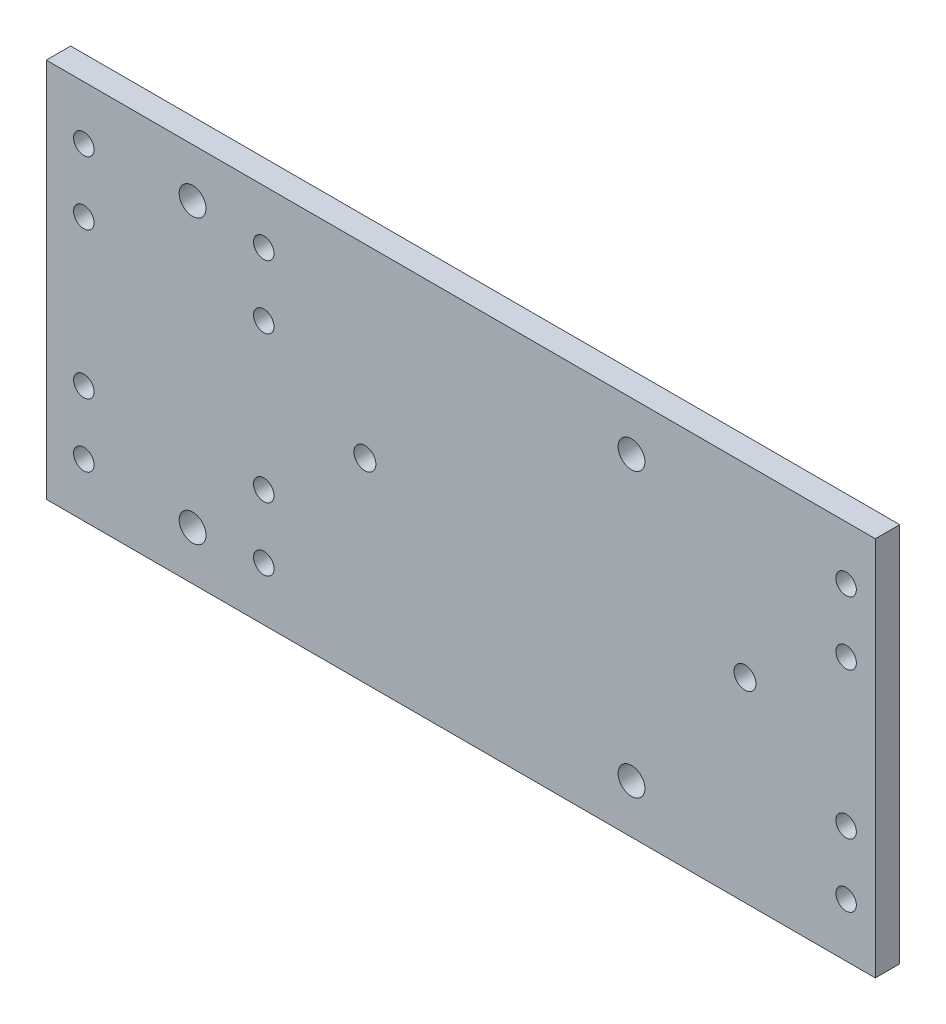
ISO-10303-21;
HEADER;
FILE_DESCRIPTION(('STEP AP214'),'2;1');
FILE_NAME('part.step','',(''),(''),'','','');
FILE_SCHEMA(('AUTOMOTIVE_DESIGN { 1 0 10303 214 1 1 1 1 }'));
ENDSEC;
DATA;
#1=APPLICATION_CONTEXT('core data for automotive mechanical design processes');
#2=APPLICATION_PROTOCOL_DEFINITION('international standard','automotive_design',2000,#1);
#3=PRODUCT_CONTEXT('',#1,'mechanical');
#4=PRODUCT('Part','Part','',(#3));
#5=PRODUCT_RELATED_PRODUCT_CATEGORY('part','',(#4));
#6=PRODUCT_DEFINITION_FORMATION('','',#4);
#7=PRODUCT_DEFINITION_CONTEXT('part definition',#1,'design');
#8=PRODUCT_DEFINITION('design','',#6,#7);
#9=PRODUCT_DEFINITION_SHAPE('','',#8);
#10=(LENGTH_UNIT() NAMED_UNIT(*) SI_UNIT(.MILLI.,.METRE.));
#11=(NAMED_UNIT(*) PLANE_ANGLE_UNIT() SI_UNIT($,.RADIAN.));
#12=(NAMED_UNIT(*) SI_UNIT($,.STERADIAN.) SOLID_ANGLE_UNIT());
#13=UNCERTAINTY_MEASURE_WITH_UNIT(LENGTH_MEASURE(1.E-05),#10,'distance_accuracy_value','');
#14=(GEOMETRIC_REPRESENTATION_CONTEXT(3) GLOBAL_UNCERTAINTY_ASSIGNED_CONTEXT((#13)) GLOBAL_UNIT_ASSIGNED_CONTEXT((#10,
#11,#12)) REPRESENTATION_CONTEXT('',''));
#15=CARTESIAN_POINT('',(0.,0.,0.));
#16=DIRECTION('',(0.,0.,1.));
#17=DIRECTION('',(1.,0.,0.));
#18=AXIS2_PLACEMENT_3D('',#15,#16,#17);
#19=CARTESIAN_POINT('',(0.,0.,5.));
#20=DIRECTION('',(0.,0.,1.));
#21=DIRECTION('',(1.,0.,0.));
#22=AXIS2_PLACEMENT_3D('',#19,#20,#21);
#23=PLANE('',#22);
#24=CARTESIAN_POINT('',(-5.99999999999992,67.0000000000001,5.));
#25=DIRECTION('',(0.,0.,1.));
#26=DIRECTION('',(1.,0.,0.));
#27=AXIS2_PLACEMENT_3D('',#24,#25,#26);
#28=CIRCLE('',#27,2.09999999999999);
#29=CARTESIAN_POINT('',(-3.89999999999993,67.0000000000001,5.));
#30=VERTEX_POINT('',#29);
#31=EDGE_CURVE('E518',#30,#30,#28,.T.);
#32=ORIENTED_EDGE('',*,*,#31,.F.);
#33=EDGE_LOOP('',(#32));
#34=FACE_BOUND('',#33,.T.);
#35=CARTESIAN_POINT('',(-5.99999999999989,24.,5.));
#36=DIRECTION('',(0.,0.,1.));
#37=DIRECTION('',(1.,0.,0.));
#38=AXIS2_PLACEMENT_3D('',#35,#36,#37);
#39=CIRCLE('',#38,2.09999999999999);
#40=CARTESIAN_POINT('',(-3.8999999999999,24.,5.));
#41=VERTEX_POINT('',#40);
#42=EDGE_CURVE('E512',#41,#41,#39,.T.);
#43=ORIENTED_EDGE('',*,*,#42,.F.);
#44=EDGE_LOOP('',(#43));
#45=FACE_BOUND('',#44,.T.);
#46=CARTESIAN_POINT('',(-5.99999999999992,11.,5.));
#47=DIRECTION('',(0.,0.,1.));
#48=DIRECTION('',(1.,0.,0.));
#49=AXIS2_PLACEMENT_3D('',#46,#47,#48);
#50=CIRCLE('',#49,2.09999999999999);
#51=CARTESIAN_POINT('',(-3.89999999999993,11.,5.));
#52=VERTEX_POINT('',#51);
#53=EDGE_CURVE('E506',#52,#52,#50,.T.);
#54=ORIENTED_EDGE('',*,*,#53,.F.);
#55=EDGE_LOOP('',(#54));
#56=FACE_BOUND('',#55,.T.);
#57=CARTESIAN_POINT('',(-5.99999999999989,54.0000000000001,5.));
#58=DIRECTION('',(0.,0.,1.));
#59=DIRECTION('',(1.,0.,0.));
#60=AXIS2_PLACEMENT_3D('',#57,#58,#59);
#61=CIRCLE('',#60,2.09999999999999);
#62=CARTESIAN_POINT('',(-3.8999999999999,54.0000000000001,5.));
#63=VERTEX_POINT('',#62);
#64=EDGE_CURVE('E500',#63,#63,#61,.T.);
#65=ORIENTED_EDGE('',*,*,#64,.F.);
#66=EDGE_LOOP('',(#65));
#67=FACE_BOUND('',#66,.T.);
#68=CARTESIAN_POINT('',(-125.4,67.0000000000001,5.));
#69=DIRECTION('',(0.,0.,1.));
#70=DIRECTION('',(1.,0.,0.));
#71=AXIS2_PLACEMENT_3D('',#68,#69,#70);
#72=CIRCLE('',#71,2.09999999999999);
#73=CARTESIAN_POINT('',(-123.3,67.0000000000001,5.));
#74=VERTEX_POINT('',#73);
#75=EDGE_CURVE('E494',#74,#74,#72,.T.);
#76=ORIENTED_EDGE('',*,*,#75,.F.);
#77=EDGE_LOOP('',(#76));
#78=FACE_BOUND('',#77,.T.);
#79=CARTESIAN_POINT('',(-125.4,24.,5.));
#80=DIRECTION('',(0.,0.,1.));
#81=DIRECTION('',(1.,0.,0.));
#82=AXIS2_PLACEMENT_3D('',#79,#80,#81);
#83=CIRCLE('',#82,2.09999999999999);
#84=CARTESIAN_POINT('',(-123.3,24.,5.));
#85=VERTEX_POINT('',#84);
#86=EDGE_CURVE('E488',#85,#85,#83,.T.);
#87=ORIENTED_EDGE('',*,*,#86,.F.);
#88=EDGE_LOOP('',(#87));
#89=FACE_BOUND('',#88,.T.);
#90=CARTESIAN_POINT('',(-125.4,11.,5.));
#91=DIRECTION('',(0.,0.,1.));
#92=DIRECTION('',(1.,0.,0.));
#93=AXIS2_PLACEMENT_3D('',#90,#91,#92);
#94=CIRCLE('',#93,2.09999999999999);
#95=CARTESIAN_POINT('',(-123.3,11.,5.));
#96=VERTEX_POINT('',#95);
#97=EDGE_CURVE('E482',#96,#96,#94,.T.);
#98=ORIENTED_EDGE('',*,*,#97,.F.);
#99=EDGE_LOOP('',(#98));
#100=FACE_BOUND('',#99,.T.);
#101=CARTESIAN_POINT('',(-125.4,54.0000000000001,5.));
#102=DIRECTION('',(0.,0.,1.));
#103=DIRECTION('',(1.,0.,0.));
#104=AXIS2_PLACEMENT_3D('',#101,#102,#103);
#105=CIRCLE('',#104,2.09999999999999);
#106=CARTESIAN_POINT('',(-123.3,54.0000000000001,5.));
#107=VERTEX_POINT('',#106);
#108=EDGE_CURVE('E473',#107,#107,#105,.T.);
#109=ORIENTED_EDGE('',*,*,#108,.F.);
#110=EDGE_LOOP('',(#109));
#111=FACE_BOUND('',#110,.T.);
#112=CARTESIAN_POINT('',(-162.3,54.0000000000001,5.));
#113=DIRECTION('',(0.,0.,1.));
#114=DIRECTION('',(1.,0.,0.));
#115=AXIS2_PLACEMENT_3D('',#112,#113,#114);
#116=CIRCLE('',#115,2.09999999999999);
#117=CARTESIAN_POINT('',(-160.2,54.0000000000001,5.));
#118=VERTEX_POINT('',#117);
#119=EDGE_CURVE('E129',#118,#118,#116,.T.);
#120=ORIENTED_EDGE('',*,*,#119,.F.);
#121=EDGE_LOOP('',(#120));
#122=FACE_BOUND('',#121,.T.);
#123=CARTESIAN_POINT('',(-162.3,67.0000000000001,5.));
#124=DIRECTION('',(0.,0.,1.));
#125=DIRECTION('',(1.,0.,0.));
#126=AXIS2_PLACEMENT_3D('',#123,#124,#125);
#127=CIRCLE('',#126,2.09999999999999);
#128=CARTESIAN_POINT('',(-160.2,67.0000000000001,5.));
#129=VERTEX_POINT('',#128);
#130=EDGE_CURVE('E119',#129,#129,#127,.T.);
#131=ORIENTED_EDGE('',*,*,#130,.F.);
#132=EDGE_LOOP('',(#131));
#133=FACE_BOUND('',#132,.T.);
#134=CARTESIAN_POINT('',(-162.3,24.,5.));
#135=DIRECTION('',(0.,0.,1.));
#136=DIRECTION('',(1.,0.,0.));
#137=AXIS2_PLACEMENT_3D('',#134,#135,#136);
#138=CIRCLE('',#137,2.09999999999999);
#139=CARTESIAN_POINT('',(-160.2,24.,5.));
#140=VERTEX_POINT('',#139);
#141=EDGE_CURVE('E116',#140,#140,#138,.T.);
#142=ORIENTED_EDGE('',*,*,#141,.F.);
#143=EDGE_LOOP('',(#142));
#144=FACE_BOUND('',#143,.T.);
#145=CARTESIAN_POINT('',(-162.3,11.,5.));
#146=DIRECTION('',(0.,0.,1.));
#147=DIRECTION('',(1.,0.,0.));
#148=AXIS2_PLACEMENT_3D('',#145,#146,#147);
#149=CIRCLE('',#148,2.09999999999999);
#150=CARTESIAN_POINT('',(-160.2,11.,5.));
#151=VERTEX_POINT('',#150);
#152=EDGE_CURVE('E115',#151,#151,#149,.T.);
#153=ORIENTED_EDGE('',*,*,#152,.F.);
#154=EDGE_LOOP('',(#153));
#155=FACE_BOUND('',#154,.T.);
#156=CARTESIAN_POINT('',(-104.663399999999,39.9999999999976,5.));
#157=DIRECTION('',(0.,0.,1.));
#158=DIRECTION('',(1.,0.,0.));
#159=AXIS2_PLACEMENT_3D('',#156,#157,#158);
#160=CIRCLE('',#159,2.25000000000008);
#161=CARTESIAN_POINT('',(-102.413399999999,39.9999999999976,5.));
#162=VERTEX_POINT('',#161);
#163=EDGE_CURVE('E145',#162,#162,#160,.T.);
#164=ORIENTED_EDGE('',*,*,#163,.F.);
#165=EDGE_LOOP('',(#164));
#166=FACE_BOUND('',#165,.T.);
#167=CARTESIAN_POINT('',(-49.9999999999998,10.,5.));
#168=DIRECTION('',(0.,0.,1.));
#169=DIRECTION('',(1.,0.,0.));
#170=AXIS2_PLACEMENT_3D('',#167,#168,#169);
#171=CIRCLE('',#170,2.74999999999981);
#172=CARTESIAN_POINT('',(-47.25,10.,5.));
#173=VERTEX_POINT('',#172);
#174=EDGE_CURVE('E157',#173,#173,#171,.T.);
#175=ORIENTED_EDGE('',*,*,#174,.F.);
#176=EDGE_LOOP('',(#175));
#177=FACE_BOUND('',#176,.T.);
#178=CARTESIAN_POINT('',(-140.,68.0000000000003,5.));
#179=DIRECTION('',(0.,0.,1.));
#180=DIRECTION('',(1.,0.,0.));
#181=AXIS2_PLACEMENT_3D('',#178,#179,#180);
#182=CIRCLE('',#181,2.74999999999981);
#183=CARTESIAN_POINT('',(-137.25,68.0000000000003,5.));
#184=VERTEX_POINT('',#183);
#185=EDGE_CURVE('E107',#184,#184,#182,.T.);
#186=ORIENTED_EDGE('',*,*,#185,.F.);
#187=EDGE_LOOP('',(#186));
#188=FACE_BOUND('',#187,.T.);
#189=DIRECTION('',(0.,1.,0.));
#190=VECTOR('',#189,1.);
#191=CARTESIAN_POINT('',(0.,0.,5.));
#192=LINE('',#191,#190);
#193=CARTESIAN_POINT('',(0.,0.,5.));
#194=VERTEX_POINT('',#193);
#195=CARTESIAN_POINT('',(0.,78.0000000000001,5.));
#196=VERTEX_POINT('',#195);
#197=EDGE_CURVE('E91',#194,#196,#192,.T.);
#198=ORIENTED_EDGE('',*,*,#197,.T.);
#199=DIRECTION('',(-1.,0.,0.));
#200=VECTOR('',#199,1.);
#201=CARTESIAN_POINT('',(0.,78.0000000000001,5.));
#202=LINE('',#201,#200);
#203=CARTESIAN_POINT('',(-170.,78.0000000000001,5.));
#204=VERTEX_POINT('',#203);
#205=EDGE_CURVE('E86',#196,#204,#202,.T.);
#206=ORIENTED_EDGE('',*,*,#205,.T.);
#207=DIRECTION('',(0.,-1.,0.));
#208=VECTOR('',#207,1.);
#209=CARTESIAN_POINT('',(-170.,78.0000000000001,5.));
#210=LINE('',#209,#208);
#211=CARTESIAN_POINT('',(-170.,0.,5.));
#212=VERTEX_POINT('',#211);
#213=EDGE_CURVE('E89',#204,#212,#210,.T.);
#214=ORIENTED_EDGE('',*,*,#213,.T.);
#215=DIRECTION('',(1.,0.,0.));
#216=VECTOR('',#215,1.);
#217=CARTESIAN_POINT('',(-170.,0.,5.));
#218=LINE('',#217,#216);
#219=EDGE_CURVE('E56',#212,#194,#218,.T.);
#220=ORIENTED_EDGE('',*,*,#219,.T.);
#221=EDGE_LOOP('',(#198,#206,#214,#220));
#222=FACE_BOUND('',#221,.T.);
#223=CARTESIAN_POINT('',(-140.,10.,5.));
#224=DIRECTION('',(0.,0.,1.));
#225=DIRECTION('',(1.,0.,0.));
#226=AXIS2_PLACEMENT_3D('',#223,#224,#225);
#227=CIRCLE('',#226,2.74999999999981);
#228=CARTESIAN_POINT('',(-137.25,10.,5.));
#229=VERTEX_POINT('',#228);
#230=EDGE_CURVE('E163',#229,#229,#227,.T.);
#231=ORIENTED_EDGE('',*,*,#230,.F.);
#232=EDGE_LOOP('',(#231));
#233=FACE_BOUND('',#232,.T.);
#234=CARTESIAN_POINT('',(-49.9999999999998,68.0000000000003,5.));
#235=DIRECTION('',(0.,0.,1.));
#236=DIRECTION('',(1.,0.,0.));
#237=AXIS2_PLACEMENT_3D('',#234,#235,#236);
#238=CIRCLE('',#237,2.74999999999981);
#239=CARTESIAN_POINT('',(-47.25,68.0000000000003,5.));
#240=VERTEX_POINT('',#239);
#241=EDGE_CURVE('E151',#240,#240,#238,.T.);
#242=ORIENTED_EDGE('',*,*,#241,.F.);
#243=EDGE_LOOP('',(#242));
#244=FACE_BOUND('',#243,.T.);
#245=CARTESIAN_POINT('',(-26.7333999999995,40.,5.));
#246=DIRECTION('',(0.,0.,1.));
#247=DIRECTION('',(1.,0.,0.));
#248=AXIS2_PLACEMENT_3D('',#245,#246,#247);
#249=CIRCLE('',#248,2.25000000000009);
#250=CARTESIAN_POINT('',(-24.4833999999994,40.,5.));
#251=VERTEX_POINT('',#250);
#252=EDGE_CURVE('E139',#251,#251,#249,.T.);
#253=ORIENTED_EDGE('',*,*,#252,.F.);
#254=EDGE_LOOP('',(#253));
#255=FACE_BOUND('',#254,.T.);
#256=ADVANCED_FACE('F37',(#34,#45,#56,#67,#78,#89,#100,#111,#122,#133,#144,#155,#166,#177,#188,
#222,#233,#244,#255),#23,.T.);
#257=CARTESIAN_POINT('',(0.,0.,0.));
#258=DIRECTION('',(0.,0.,1.));
#259=DIRECTION('',(1.,0.,0.));
#260=AXIS2_PLACEMENT_3D('',#257,#258,#259);
#261=PLANE('',#260);
#262=CARTESIAN_POINT('',(-5.99999999999992,67.0000000000001,0.));
#263=DIRECTION('',(0.,0.,1.));
#264=DIRECTION('',(1.,0.,0.));
#265=AXIS2_PLACEMENT_3D('',#262,#263,#264);
#266=CIRCLE('',#265,2.09999999999999);
#267=CARTESIAN_POINT('',(-3.89999999999993,67.0000000000001,0.));
#268=VERTEX_POINT('',#267);
#269=EDGE_CURVE('E515',#268,#268,#266,.T.);
#270=ORIENTED_EDGE('',*,*,#269,.T.);
#271=EDGE_LOOP('',(#270));
#272=FACE_BOUND('',#271,.T.);
#273=CARTESIAN_POINT('',(-5.99999999999989,24.,0.));
#274=DIRECTION('',(0.,0.,1.));
#275=DIRECTION('',(1.,0.,0.));
#276=AXIS2_PLACEMENT_3D('',#273,#274,#275);
#277=CIRCLE('',#276,2.09999999999999);
#278=CARTESIAN_POINT('',(-3.8999999999999,24.,0.));
#279=VERTEX_POINT('',#278);
#280=EDGE_CURVE('E509',#279,#279,#277,.T.);
#281=ORIENTED_EDGE('',*,*,#280,.T.);
#282=EDGE_LOOP('',(#281));
#283=FACE_BOUND('',#282,.T.);
#284=CARTESIAN_POINT('',(-5.99999999999992,11.,0.));
#285=DIRECTION('',(0.,0.,1.));
#286=DIRECTION('',(1.,0.,0.));
#287=AXIS2_PLACEMENT_3D('',#284,#285,#286);
#288=CIRCLE('',#287,2.09999999999999);
#289=CARTESIAN_POINT('',(-3.89999999999993,11.,0.));
#290=VERTEX_POINT('',#289);
#291=EDGE_CURVE('E503',#290,#290,#288,.T.);
#292=ORIENTED_EDGE('',*,*,#291,.T.);
#293=EDGE_LOOP('',(#292));
#294=FACE_BOUND('',#293,.T.);
#295=CARTESIAN_POINT('',(-5.99999999999989,54.0000000000001,0.));
#296=DIRECTION('',(0.,0.,1.));
#297=DIRECTION('',(1.,0.,0.));
#298=AXIS2_PLACEMENT_3D('',#295,#296,#297);
#299=CIRCLE('',#298,2.09999999999999);
#300=CARTESIAN_POINT('',(-3.8999999999999,54.0000000000001,0.));
#301=VERTEX_POINT('',#300);
#302=EDGE_CURVE('E497',#301,#301,#299,.T.);
#303=ORIENTED_EDGE('',*,*,#302,.T.);
#304=EDGE_LOOP('',(#303));
#305=FACE_BOUND('',#304,.T.);
#306=CARTESIAN_POINT('',(-125.4,67.0000000000001,0.));
#307=DIRECTION('',(0.,0.,1.));
#308=DIRECTION('',(1.,0.,0.));
#309=AXIS2_PLACEMENT_3D('',#306,#307,#308);
#310=CIRCLE('',#309,2.09999999999999);
#311=CARTESIAN_POINT('',(-123.3,67.0000000000001,0.));
#312=VERTEX_POINT('',#311);
#313=EDGE_CURVE('E491',#312,#312,#310,.T.);
#314=ORIENTED_EDGE('',*,*,#313,.T.);
#315=EDGE_LOOP('',(#314));
#316=FACE_BOUND('',#315,.T.);
#317=CARTESIAN_POINT('',(-125.4,24.,0.));
#318=DIRECTION('',(0.,0.,1.));
#319=DIRECTION('',(1.,0.,0.));
#320=AXIS2_PLACEMENT_3D('',#317,#318,#319);
#321=CIRCLE('',#320,2.09999999999999);
#322=CARTESIAN_POINT('',(-123.3,24.,0.));
#323=VERTEX_POINT('',#322);
#324=EDGE_CURVE('E485',#323,#323,#321,.T.);
#325=ORIENTED_EDGE('',*,*,#324,.T.);
#326=EDGE_LOOP('',(#325));
#327=FACE_BOUND('',#326,.T.);
#328=CARTESIAN_POINT('',(-125.4,11.,0.));
#329=DIRECTION('',(0.,0.,1.));
#330=DIRECTION('',(1.,0.,0.));
#331=AXIS2_PLACEMENT_3D('',#328,#329,#330);
#332=CIRCLE('',#331,2.09999999999999);
#333=CARTESIAN_POINT('',(-123.3,11.,0.));
#334=VERTEX_POINT('',#333);
#335=EDGE_CURVE('E477',#334,#334,#332,.T.);
#336=ORIENTED_EDGE('',*,*,#335,.T.);
#337=EDGE_LOOP('',(#336));
#338=FACE_BOUND('',#337,.T.);
#339=CARTESIAN_POINT('',(-125.4,54.0000000000001,0.));
#340=DIRECTION('',(0.,0.,1.));
#341=DIRECTION('',(1.,0.,0.));
#342=AXIS2_PLACEMENT_3D('',#339,#340,#341);
#343=CIRCLE('',#342,2.09999999999999);
#344=CARTESIAN_POINT('',(-123.3,54.0000000000001,0.));
#345=VERTEX_POINT('',#344);
#346=EDGE_CURVE('E471',#345,#345,#343,.T.);
#347=ORIENTED_EDGE('',*,*,#346,.T.);
#348=EDGE_LOOP('',(#347));
#349=FACE_BOUND('',#348,.T.);
#350=CARTESIAN_POINT('',(-162.3,54.0000000000001,0.));
#351=DIRECTION('',(0.,0.,1.));
#352=DIRECTION('',(1.,0.,0.));
#353=AXIS2_PLACEMENT_3D('',#350,#351,#352);
#354=CIRCLE('',#353,2.09999999999999);
#355=CARTESIAN_POINT('',(-160.2,54.0000000000001,0.));
#356=VERTEX_POINT('',#355);
#357=EDGE_CURVE('E41',#356,#356,#354,.T.);
#358=ORIENTED_EDGE('',*,*,#357,.T.);
#359=EDGE_LOOP('',(#358));
#360=FACE_BOUND('',#359,.T.);
#361=CARTESIAN_POINT('',(-162.3,67.0000000000001,0.));
#362=DIRECTION('',(0.,0.,1.));
#363=DIRECTION('',(1.,0.,0.));
#364=AXIS2_PLACEMENT_3D('',#361,#362,#363);
#365=CIRCLE('',#364,2.09999999999999);
#366=CARTESIAN_POINT('',(-160.2,67.0000000000001,0.));
#367=VERTEX_POINT('',#366);
#368=EDGE_CURVE('E117',#367,#367,#365,.T.);
#369=ORIENTED_EDGE('',*,*,#368,.T.);
#370=EDGE_LOOP('',(#369));
#371=FACE_BOUND('',#370,.T.);
#372=CARTESIAN_POINT('',(-162.3,24.,0.));
#373=DIRECTION('',(0.,0.,1.));
#374=DIRECTION('',(1.,0.,0.));
#375=AXIS2_PLACEMENT_3D('',#372,#373,#374);
#376=CIRCLE('',#375,2.09999999999999);
#377=CARTESIAN_POINT('',(-160.2,24.,0.));
#378=VERTEX_POINT('',#377);
#379=EDGE_CURVE('E113',#378,#378,#376,.T.);
#380=ORIENTED_EDGE('',*,*,#379,.T.);
#381=EDGE_LOOP('',(#380));
#382=FACE_BOUND('',#381,.T.);
#383=CARTESIAN_POINT('',(-162.3,11.,0.));
#384=DIRECTION('',(0.,0.,1.));
#385=DIRECTION('',(1.,0.,0.));
#386=AXIS2_PLACEMENT_3D('',#383,#384,#385);
#387=CIRCLE('',#386,2.09999999999999);
#388=CARTESIAN_POINT('',(-160.2,11.,0.));
#389=VERTEX_POINT('',#388);
#390=EDGE_CURVE('E135',#389,#389,#387,.T.);
#391=ORIENTED_EDGE('',*,*,#390,.T.);
#392=EDGE_LOOP('',(#391));
#393=FACE_BOUND('',#392,.T.);
#394=DIRECTION('',(0.,1.,0.));
#395=VECTOR('',#394,1.);
#396=CARTESIAN_POINT('',(0.,0.,0.));
#397=LINE('',#396,#395);
#398=CARTESIAN_POINT('',(0.,0.,0.));
#399=VERTEX_POINT('',#398);
#400=CARTESIAN_POINT('',(0.,78.0000000000001,0.));
#401=VERTEX_POINT('',#400);
#402=EDGE_CURVE('E104',#399,#401,#397,.T.);
#403=ORIENTED_EDGE('',*,*,#402,.F.);
#404=DIRECTION('',(1.,0.,0.));
#405=VECTOR('',#404,1.);
#406=CARTESIAN_POINT('',(-170.,0.,0.));
#407=LINE('',#406,#405);
#408=CARTESIAN_POINT('',(-170.,0.,0.));
#409=VERTEX_POINT('',#408);
#410=EDGE_CURVE('E79',#409,#399,#407,.T.);
#411=ORIENTED_EDGE('',*,*,#410,.F.);
#412=DIRECTION('',(0.,-1.,0.));
#413=VECTOR('',#412,1.);
#414=CARTESIAN_POINT('',(-170.,78.0000000000001,0.));
#415=LINE('',#414,#413);
#416=CARTESIAN_POINT('',(-170.,78.0000000000001,0.));
#417=VERTEX_POINT('',#416);
#418=EDGE_CURVE('E73',#417,#409,#415,.T.);
#419=ORIENTED_EDGE('',*,*,#418,.F.);
#420=DIRECTION('',(-1.,0.,0.));
#421=VECTOR('',#420,1.);
#422=CARTESIAN_POINT('',(0.,78.0000000000001,0.));
#423=LINE('',#422,#421);
#424=EDGE_CURVE('E95',#401,#417,#423,.T.);
#425=ORIENTED_EDGE('',*,*,#424,.F.);
#426=EDGE_LOOP('',(#403,#411,#419,#425));
#427=FACE_BOUND('',#426,.T.);
#428=CARTESIAN_POINT('',(-140.,68.0000000000003,0.));
#429=DIRECTION('',(0.,0.,1.));
#430=DIRECTION('',(1.,0.,0.));
#431=AXIS2_PLACEMENT_3D('',#428,#429,#430);
#432=CIRCLE('',#431,2.74999999999981);
#433=CARTESIAN_POINT('',(-137.25,68.0000000000003,0.));
#434=VERTEX_POINT('',#433);
#435=EDGE_CURVE('E166',#434,#434,#432,.T.);
#436=ORIENTED_EDGE('',*,*,#435,.T.);
#437=EDGE_LOOP('',(#436));
#438=FACE_BOUND('',#437,.T.);
#439=CARTESIAN_POINT('',(-140.,10.,0.));
#440=DIRECTION('',(0.,0.,1.));
#441=DIRECTION('',(1.,0.,0.));
#442=AXIS2_PLACEMENT_3D('',#439,#440,#441);
#443=CIRCLE('',#442,2.74999999999981);
#444=CARTESIAN_POINT('',(-137.25,10.,0.));
#445=VERTEX_POINT('',#444);
#446=EDGE_CURVE('E160',#445,#445,#443,.T.);
#447=ORIENTED_EDGE('',*,*,#446,.T.);
#448=EDGE_LOOP('',(#447));
#449=FACE_BOUND('',#448,.T.);
#450=CARTESIAN_POINT('',(-49.9999999999998,10.,0.));
#451=DIRECTION('',(0.,0.,1.));
#452=DIRECTION('',(1.,0.,0.));
#453=AXIS2_PLACEMENT_3D('',#450,#451,#452);
#454=CIRCLE('',#453,2.74999999999981);
#455=CARTESIAN_POINT('',(-47.25,10.,0.));
#456=VERTEX_POINT('',#455);
#457=EDGE_CURVE('E154',#456,#456,#454,.T.);
#458=ORIENTED_EDGE('',*,*,#457,.T.);
#459=EDGE_LOOP('',(#458));
#460=FACE_BOUND('',#459,.T.);
#461=CARTESIAN_POINT('',(-49.9999999999998,68.0000000000003,0.));
#462=DIRECTION('',(0.,0.,1.));
#463=DIRECTION('',(1.,0.,0.));
#464=AXIS2_PLACEMENT_3D('',#461,#462,#463);
#465=CIRCLE('',#464,2.74999999999981);
#466=CARTESIAN_POINT('',(-47.25,68.0000000000003,0.));
#467=VERTEX_POINT('',#466);
#468=EDGE_CURVE('E148',#467,#467,#465,.T.);
#469=ORIENTED_EDGE('',*,*,#468,.T.);
#470=EDGE_LOOP('',(#469));
#471=FACE_BOUND('',#470,.T.);
#472=CARTESIAN_POINT('',(-104.663399999999,39.9999999999976,0.));
#473=DIRECTION('',(0.,0.,1.));
#474=DIRECTION('',(1.,0.,0.));
#475=AXIS2_PLACEMENT_3D('',#472,#473,#474);
#476=CIRCLE('',#475,2.25000000000008);
#477=CARTESIAN_POINT('',(-102.413399999999,39.9999999999976,0.));
#478=VERTEX_POINT('',#477);
#479=EDGE_CURVE('E142',#478,#478,#476,.T.);
#480=ORIENTED_EDGE('',*,*,#479,.T.);
#481=EDGE_LOOP('',(#480));
#482=FACE_BOUND('',#481,.T.);
#483=CARTESIAN_POINT('',(-26.7333999999995,40.,0.));
#484=DIRECTION('',(0.,0.,1.));
#485=DIRECTION('',(1.,0.,0.));
#486=AXIS2_PLACEMENT_3D('',#483,#484,#485);
#487=CIRCLE('',#486,2.25000000000009);
#488=CARTESIAN_POINT('',(-24.4833999999994,40.,0.));
#489=VERTEX_POINT('',#488);
#490=EDGE_CURVE('E138',#489,#489,#487,.T.);
#491=ORIENTED_EDGE('',*,*,#490,.T.);
#492=EDGE_LOOP('',(#491));
#493=FACE_BOUND('',#492,.T.);
#494=ADVANCED_FACE('F174',(#272,#283,#294,#305,#316,#327,#338,#349,#360,#371,#382,#393,#427,
#438,#449,#460,#471,#482,#493),#261,.F.);
#495=CARTESIAN_POINT('',(0.,0.,5.));
#496=DIRECTION('',(-1.,0.,0.));
#497=DIRECTION('',(0.,0.,1.));
#498=AXIS2_PLACEMENT_3D('',#495,#496,#497);
#499=PLANE('',#498);
#500=ORIENTED_EDGE('',*,*,#402,.T.);
#501=DIRECTION('',(0.,0.,-1.));
#502=VECTOR('',#501,1.);
#503=CARTESIAN_POINT('',(0.,78.0000000000001,5.));
#504=LINE('',#503,#502);
#505=EDGE_CURVE('E11',#196,#401,#504,.T.);
#506=ORIENTED_EDGE('',*,*,#505,.F.);
#507=ORIENTED_EDGE('',*,*,#197,.F.);
#508=DIRECTION('',(0.,0.,-1.));
#509=VECTOR('',#508,1.);
#510=CARTESIAN_POINT('',(0.,0.,5.));
#511=LINE('',#510,#509);
#512=EDGE_CURVE('E100',#194,#399,#511,.T.);
#513=ORIENTED_EDGE('',*,*,#512,.T.);
#514=EDGE_LOOP('',(#500,#506,#507,#513));
#515=FACE_BOUND('',#514,.T.);
#516=ADVANCED_FACE('F39',(#515),#499,.F.);
#517=CARTESIAN_POINT('',(0.,78.0000000000001,5.));
#518=DIRECTION('',(0.,-1.,0.));
#519=DIRECTION('',(0.,0.,-1.));
#520=AXIS2_PLACEMENT_3D('',#517,#518,#519);
#521=PLANE('',#520);
#522=ORIENTED_EDGE('',*,*,#424,.T.);
#523=DIRECTION('',(0.,0.,-1.));
#524=VECTOR('',#523,1.);
#525=CARTESIAN_POINT('',(-170.,78.0000000000001,5.));
#526=LINE('',#525,#524);
#527=EDGE_CURVE('E47',#204,#417,#526,.T.);
#528=ORIENTED_EDGE('',*,*,#527,.F.);
#529=ORIENTED_EDGE('',*,*,#205,.F.);
#530=ORIENTED_EDGE('',*,*,#505,.T.);
#531=EDGE_LOOP('',(#522,#528,#529,#530));
#532=FACE_BOUND('',#531,.T.);
#533=ADVANCED_FACE('F94',(#532),#521,.F.);
#534=CARTESIAN_POINT('',(-170.,78.0000000000001,5.));
#535=DIRECTION('',(1.,0.,0.));
#536=DIRECTION('',(0.,0.,-1.));
#537=AXIS2_PLACEMENT_3D('',#534,#535,#536);
#538=PLANE('',#537);
#539=ORIENTED_EDGE('',*,*,#418,.T.);
#540=DIRECTION('',(0.,0.,-1.));
#541=VECTOR('',#540,1.);
#542=CARTESIAN_POINT('',(-170.,0.,5.));
#543=LINE('',#542,#541);
#544=EDGE_CURVE('E96',#212,#409,#543,.T.);
#545=ORIENTED_EDGE('',*,*,#544,.F.);
#546=ORIENTED_EDGE('',*,*,#213,.F.);
#547=ORIENTED_EDGE('',*,*,#527,.T.);
#548=EDGE_LOOP('',(#539,#545,#546,#547));
#549=FACE_BOUND('',#548,.T.);
#550=ADVANCED_FACE('F98',(#549),#538,.F.);
#551=CARTESIAN_POINT('',(-170.,0.,5.));
#552=DIRECTION('',(0.,1.,0.));
#553=DIRECTION('',(0.,0.,1.));
#554=AXIS2_PLACEMENT_3D('',#551,#552,#553);
#555=PLANE('',#554);
#556=ORIENTED_EDGE('',*,*,#410,.T.);
#557=ORIENTED_EDGE('',*,*,#512,.F.);
#558=ORIENTED_EDGE('',*,*,#219,.F.);
#559=ORIENTED_EDGE('',*,*,#544,.T.);
#560=EDGE_LOOP('',(#556,#557,#558,#559));
#561=FACE_BOUND('',#560,.T.);
#562=ADVANCED_FACE('F180',(#561),#555,.F.);
#563=CARTESIAN_POINT('',(-140.,68.0000000000003,5.));
#564=DIRECTION('',(0.,0.,-1.));
#565=DIRECTION('',(-1.,0.,0.));
#566=AXIS2_PLACEMENT_3D('',#563,#564,#565);
#567=CYLINDRICAL_SURFACE('',#566,2.74999999999981);
#568=ORIENTED_EDGE('',*,*,#185,.T.);
#569=EDGE_LOOP('',(#568));
#570=FACE_BOUND('',#569,.T.);
#571=ORIENTED_EDGE('',*,*,#435,.F.);
#572=EDGE_LOOP('',(#571));
#573=FACE_BOUND('',#572,.T.);
#574=ADVANCED_FACE('F177',(#570,#573),#567,.F.);
#575=CARTESIAN_POINT('',(-140.,10.,5.));
#576=DIRECTION('',(0.,0.,-1.));
#577=DIRECTION('',(-1.,0.,0.));
#578=AXIS2_PLACEMENT_3D('',#575,#576,#577);
#579=CYLINDRICAL_SURFACE('',#578,2.74999999999981);
#580=ORIENTED_EDGE('',*,*,#230,.T.);
#581=EDGE_LOOP('',(#580));
#582=FACE_BOUND('',#581,.T.);
#583=ORIENTED_EDGE('',*,*,#446,.F.);
#584=EDGE_LOOP('',(#583));
#585=FACE_BOUND('',#584,.T.);
#586=ADVANCED_FACE('F179',(#582,#585),#579,.F.);
#587=CARTESIAN_POINT('',(-49.9999999999998,10.,5.));
#588=DIRECTION('',(0.,0.,-1.));
#589=DIRECTION('',(-1.,0.,0.));
#590=AXIS2_PLACEMENT_3D('',#587,#588,#589);
#591=CYLINDRICAL_SURFACE('',#590,2.74999999999981);
#592=ORIENTED_EDGE('',*,*,#174,.T.);
#593=EDGE_LOOP('',(#592));
#594=FACE_BOUND('',#593,.T.);
#595=ORIENTED_EDGE('',*,*,#457,.F.);
#596=EDGE_LOOP('',(#595));
#597=FACE_BOUND('',#596,.T.);
#598=ADVANCED_FACE('F187',(#594,#597),#591,.F.);
#599=CARTESIAN_POINT('',(-49.9999999999998,68.0000000000003,5.));
#600=DIRECTION('',(0.,0.,-1.));
#601=DIRECTION('',(-1.,0.,0.));
#602=AXIS2_PLACEMENT_3D('',#599,#600,#601);
#603=CYLINDRICAL_SURFACE('',#602,2.74999999999981);
#604=ORIENTED_EDGE('',*,*,#241,.T.);
#605=EDGE_LOOP('',(#604));
#606=FACE_BOUND('',#605,.T.);
#607=ORIENTED_EDGE('',*,*,#468,.F.);
#608=EDGE_LOOP('',(#607));
#609=FACE_BOUND('',#608,.T.);
#610=ADVANCED_FACE('F347',(#606,#609),#603,.F.);
#611=CARTESIAN_POINT('',(-104.663399999999,39.9999999999976,5.));
#612=DIRECTION('',(0.,0.,-1.));
#613=DIRECTION('',(-1.,0.,0.));
#614=AXIS2_PLACEMENT_3D('',#611,#612,#613);
#615=CYLINDRICAL_SURFACE('',#614,2.25000000000008);
#616=ORIENTED_EDGE('',*,*,#163,.T.);
#617=EDGE_LOOP('',(#616));
#618=FACE_BOUND('',#617,.T.);
#619=ORIENTED_EDGE('',*,*,#479,.F.);
#620=EDGE_LOOP('',(#619));
#621=FACE_BOUND('',#620,.T.);
#622=ADVANCED_FACE('F339',(#618,#621),#615,.F.);
#623=CARTESIAN_POINT('',(-26.7333999999995,40.,5.));
#624=DIRECTION('',(0.,0.,-1.));
#625=DIRECTION('',(-1.,0.,0.));
#626=AXIS2_PLACEMENT_3D('',#623,#624,#625);
#627=CYLINDRICAL_SURFACE('',#626,2.25000000000009);
#628=ORIENTED_EDGE('',*,*,#252,.T.);
#629=EDGE_LOOP('',(#628));
#630=FACE_BOUND('',#629,.T.);
#631=ORIENTED_EDGE('',*,*,#490,.F.);
#632=EDGE_LOOP('',(#631));
#633=FACE_BOUND('',#632,.T.);
#634=ADVANCED_FACE('F331',(#630,#633),#627,.F.);
#635=CARTESIAN_POINT('',(-162.3,11.,5.));
#636=DIRECTION('',(0.,0.,1.));
#637=DIRECTION('',(1.,0.,0.));
#638=AXIS2_PLACEMENT_3D('',#635,#636,#637);
#639=CYLINDRICAL_SURFACE('',#638,2.09999999999999);
#640=ORIENTED_EDGE('',*,*,#152,.T.);
#641=EDGE_LOOP('',(#640));
#642=FACE_BOUND('',#641,.T.);
#643=ORIENTED_EDGE('',*,*,#390,.F.);
#644=EDGE_LOOP('',(#643));
#645=FACE_BOUND('',#644,.T.);
#646=ADVANCED_FACE('F323',(#642,#645),#639,.F.);
#647=CARTESIAN_POINT('',(-162.3,24.,5.));
#648=DIRECTION('',(0.,0.,1.));
#649=DIRECTION('',(1.,0.,0.));
#650=AXIS2_PLACEMENT_3D('',#647,#648,#649);
#651=CYLINDRICAL_SURFACE('',#650,2.09999999999999);
#652=ORIENTED_EDGE('',*,*,#141,.T.);
#653=EDGE_LOOP('',(#652));
#654=FACE_BOUND('',#653,.T.);
#655=ORIENTED_EDGE('',*,*,#379,.F.);
#656=EDGE_LOOP('',(#655));
#657=FACE_BOUND('',#656,.T.);
#658=ADVANCED_FACE('F316',(#654,#657),#651,.F.);
#659=CARTESIAN_POINT('',(-162.3,67.0000000000001,5.));
#660=DIRECTION('',(0.,0.,1.));
#661=DIRECTION('',(1.,0.,0.));
#662=AXIS2_PLACEMENT_3D('',#659,#660,#661);
#663=CYLINDRICAL_SURFACE('',#662,2.09999999999999);
#664=ORIENTED_EDGE('',*,*,#130,.T.);
#665=EDGE_LOOP('',(#664));
#666=FACE_BOUND('',#665,.T.);
#667=ORIENTED_EDGE('',*,*,#368,.F.);
#668=EDGE_LOOP('',(#667));
#669=FACE_BOUND('',#668,.T.);
#670=ADVANCED_FACE('F308',(#666,#669),#663,.F.);
#671=CARTESIAN_POINT('',(-162.3,54.0000000000001,5.));
#672=DIRECTION('',(0.,0.,1.));
#673=DIRECTION('',(1.,0.,0.));
#674=AXIS2_PLACEMENT_3D('',#671,#672,#673);
#675=CYLINDRICAL_SURFACE('',#674,2.09999999999999);
#676=ORIENTED_EDGE('',*,*,#119,.T.);
#677=EDGE_LOOP('',(#676));
#678=FACE_BOUND('',#677,.T.);
#679=ORIENTED_EDGE('',*,*,#357,.F.);
#680=EDGE_LOOP('',(#679));
#681=FACE_BOUND('',#680,.T.);
#682=ADVANCED_FACE('F300',(#678,#681),#675,.F.);
#683=CARTESIAN_POINT('',(-125.4,54.0000000000001,5.));
#684=DIRECTION('',(0.,0.,1.));
#685=DIRECTION('',(1.,0.,0.));
#686=AXIS2_PLACEMENT_3D('',#683,#684,#685);
#687=CYLINDRICAL_SURFACE('',#686,2.09999999999999);
#688=ORIENTED_EDGE('',*,*,#108,.T.);
#689=EDGE_LOOP('',(#688));
#690=FACE_BOUND('',#689,.T.);
#691=ORIENTED_EDGE('',*,*,#346,.F.);
#692=EDGE_LOOP('',(#691));
#693=FACE_BOUND('',#692,.T.);
#694=ADVANCED_FACE('F293',(#690,#693),#687,.F.);
#695=CARTESIAN_POINT('',(-125.4,11.,5.));
#696=DIRECTION('',(0.,0.,1.));
#697=DIRECTION('',(1.,0.,0.));
#698=AXIS2_PLACEMENT_3D('',#695,#696,#697);
#699=CYLINDRICAL_SURFACE('',#698,2.09999999999999);
#700=ORIENTED_EDGE('',*,*,#97,.T.);
#701=EDGE_LOOP('',(#700));
#702=FACE_BOUND('',#701,.T.);
#703=ORIENTED_EDGE('',*,*,#335,.F.);
#704=EDGE_LOOP('',(#703));
#705=FACE_BOUND('',#704,.T.);
#706=ADVANCED_FACE('F286',(#702,#705),#699,.F.);
#707=CARTESIAN_POINT('',(-125.4,24.,5.));
#708=DIRECTION('',(0.,0.,1.));
#709=DIRECTION('',(1.,0.,0.));
#710=AXIS2_PLACEMENT_3D('',#707,#708,#709);
#711=CYLINDRICAL_SURFACE('',#710,2.09999999999999);
#712=ORIENTED_EDGE('',*,*,#86,.T.);
#713=EDGE_LOOP('',(#712));
#714=FACE_BOUND('',#713,.T.);
#715=ORIENTED_EDGE('',*,*,#324,.F.);
#716=EDGE_LOOP('',(#715));
#717=FACE_BOUND('',#716,.T.);
#718=ADVANCED_FACE('F278',(#714,#717),#711,.F.);
#719=CARTESIAN_POINT('',(-125.4,67.0000000000001,5.));
#720=DIRECTION('',(0.,0.,1.));
#721=DIRECTION('',(1.,0.,0.));
#722=AXIS2_PLACEMENT_3D('',#719,#720,#721);
#723=CYLINDRICAL_SURFACE('',#722,2.09999999999999);
#724=ORIENTED_EDGE('',*,*,#75,.T.);
#725=EDGE_LOOP('',(#724));
#726=FACE_BOUND('',#725,.T.);
#727=ORIENTED_EDGE('',*,*,#313,.F.);
#728=EDGE_LOOP('',(#727));
#729=FACE_BOUND('',#728,.T.);
#730=ADVANCED_FACE('F231',(#726,#729),#723,.F.);
#731=CARTESIAN_POINT('',(-5.99999999999989,54.0000000000001,5.));
#732=DIRECTION('',(0.,0.,1.));
#733=DIRECTION('',(1.,0.,0.));
#734=AXIS2_PLACEMENT_3D('',#731,#732,#733);
#735=CYLINDRICAL_SURFACE('',#734,2.09999999999999);
#736=ORIENTED_EDGE('',*,*,#64,.T.);
#737=EDGE_LOOP('',(#736));
#738=FACE_BOUND('',#737,.T.);
#739=ORIENTED_EDGE('',*,*,#302,.F.);
#740=EDGE_LOOP('',(#739));
#741=FACE_BOUND('',#740,.T.);
#742=ADVANCED_FACE('F224',(#738,#741),#735,.F.);
#743=CARTESIAN_POINT('',(-5.99999999999992,11.,5.));
#744=DIRECTION('',(0.,0.,1.));
#745=DIRECTION('',(1.,0.,0.));
#746=AXIS2_PLACEMENT_3D('',#743,#744,#745);
#747=CYLINDRICAL_SURFACE('',#746,2.09999999999999);
#748=ORIENTED_EDGE('',*,*,#53,.T.);
#749=EDGE_LOOP('',(#748));
#750=FACE_BOUND('',#749,.T.);
#751=ORIENTED_EDGE('',*,*,#291,.F.);
#752=EDGE_LOOP('',(#751));
#753=FACE_BOUND('',#752,.T.);
#754=ADVANCED_FACE('F230',(#750,#753),#747,.F.);
#755=CARTESIAN_POINT('',(-5.99999999999989,24.,5.));
#756=DIRECTION('',(0.,0.,1.));
#757=DIRECTION('',(1.,0.,0.));
#758=AXIS2_PLACEMENT_3D('',#755,#756,#757);
#759=CYLINDRICAL_SURFACE('',#758,2.09999999999999);
#760=ORIENTED_EDGE('',*,*,#42,.T.);
#761=EDGE_LOOP('',(#760));
#762=FACE_BOUND('',#761,.T.);
#763=ORIENTED_EDGE('',*,*,#280,.F.);
#764=EDGE_LOOP('',(#763));
#765=FACE_BOUND('',#764,.T.);
#766=ADVANCED_FACE('F244',(#762,#765),#759,.F.);
#767=CARTESIAN_POINT('',(-5.99999999999992,67.0000000000001,5.));
#768=DIRECTION('',(0.,0.,1.));
#769=DIRECTION('',(1.,0.,0.));
#770=AXIS2_PLACEMENT_3D('',#767,#768,#769);
#771=CYLINDRICAL_SURFACE('',#770,2.09999999999999);
#772=ORIENTED_EDGE('',*,*,#31,.T.);
#773=EDGE_LOOP('',(#772));
#774=FACE_BOUND('',#773,.T.);
#775=ORIENTED_EDGE('',*,*,#269,.F.);
#776=EDGE_LOOP('',(#775));
#777=FACE_BOUND('',#776,.T.);
#778=ADVANCED_FACE('F256',(#774,#777),#771,.F.);
#779=CLOSED_SHELL('',(#256,#494,#516,#533,#550,#562,#574,#586,#598,#610,#622,#634,#646,#658,
#670,#682,#694,#706,#718,#730,#742,#754,#766,#778));
#780=MANIFOLD_SOLID_BREP('B2',#779);
#781=ADVANCED_BREP_SHAPE_REPRESENTATION('',(#18,#780),#14);
#782=SHAPE_DEFINITION_REPRESENTATION(#9,#781);
ENDSEC;
END-ISO-10303-21;
